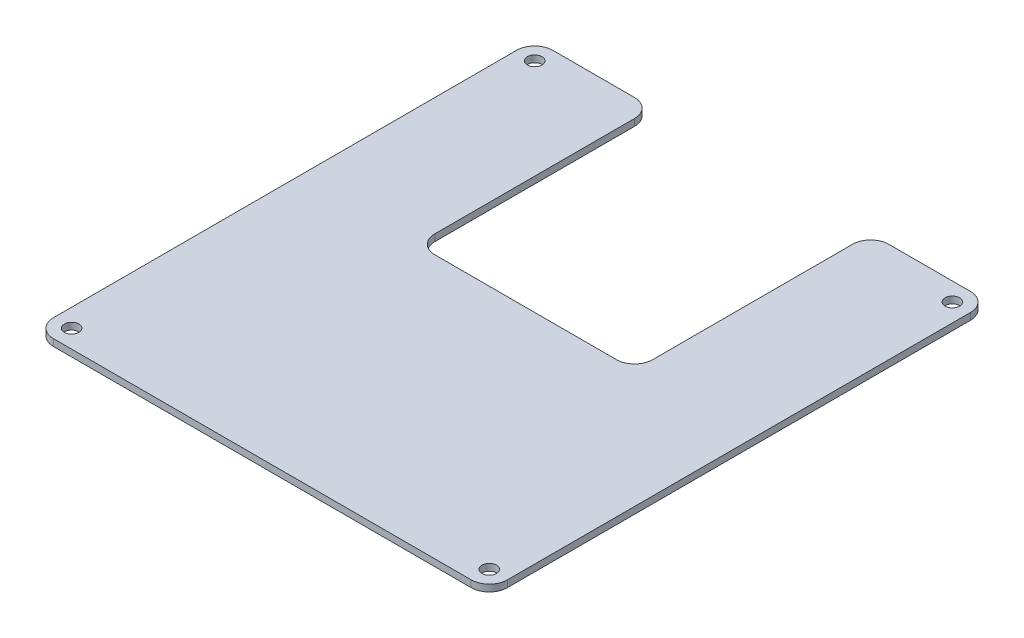
ISO-10303-21;
HEADER;
FILE_DESCRIPTION(('STEP AP214'),'2;1');
FILE_NAME('part.step','',(''),(''),'','','');
FILE_SCHEMA(('AUTOMOTIVE_DESIGN { 1 0 10303 214 1 1 1 1 }'));
ENDSEC;
DATA;
#1=APPLICATION_CONTEXT('core data for automotive mechanical design processes');
#2=APPLICATION_PROTOCOL_DEFINITION('international standard','automotive_design',2000,#1);
#3=PRODUCT_CONTEXT('',#1,'mechanical');
#4=PRODUCT('Part','Part','',(#3));
#5=PRODUCT_RELATED_PRODUCT_CATEGORY('part','',(#4));
#6=PRODUCT_DEFINITION_FORMATION('','',#4);
#7=PRODUCT_DEFINITION_CONTEXT('part definition',#1,'design');
#8=PRODUCT_DEFINITION('design','',#6,#7);
#9=PRODUCT_DEFINITION_SHAPE('','',#8);
#10=(LENGTH_UNIT() NAMED_UNIT(*) SI_UNIT(.MILLI.,.METRE.));
#11=(NAMED_UNIT(*) PLANE_ANGLE_UNIT() SI_UNIT($,.RADIAN.));
#12=(NAMED_UNIT(*) SI_UNIT($,.STERADIAN.) SOLID_ANGLE_UNIT());
#13=UNCERTAINTY_MEASURE_WITH_UNIT(LENGTH_MEASURE(1.E-05),#10,'distance_accuracy_value','');
#14=(GEOMETRIC_REPRESENTATION_CONTEXT(3) GLOBAL_UNCERTAINTY_ASSIGNED_CONTEXT((#13)) GLOBAL_UNIT_ASSIGNED_CONTEXT((#10,
#11,#12)) REPRESENTATION_CONTEXT('',''));
#15=CARTESIAN_POINT('',(0.,0.,0.));
#16=DIRECTION('',(0.,0.,1.));
#17=DIRECTION('',(1.,0.,0.));
#18=AXIS2_PLACEMENT_3D('',#15,#16,#17);
#19=CARTESIAN_POINT('',(-50.,1.5,-55.));
#20=DIRECTION('',(0.,0.,1.));
#21=DIRECTION('',(1.,0.,0.));
#22=AXIS2_PLACEMENT_3D('',#19,#20,#21);
#23=PLANE('',#22);
#24=DIRECTION('',(-1.,0.,0.));
#25=VECTOR('',#24,1.);
#26=CARTESIAN_POINT('',(-50.,1.5,-55.));
#27=LINE('',#26,#25);
#28=CARTESIAN_POINT('',(-28.,1.5,-55.));
#29=VERTEX_POINT('',#28);
#30=CARTESIAN_POINT('',(-46.,1.5,-55.));
#31=VERTEX_POINT('',#30);
#32=EDGE_CURVE('E197',#29,#31,#27,.T.);
#33=ORIENTED_EDGE('',*,*,#32,.F.);
#34=DIRECTION('',(0.,-1.,0.));
#35=VECTOR('',#34,1.);
#36=CARTESIAN_POINT('',(-28.,1.5,-55.));
#37=LINE('',#36,#35);
#38=CARTESIAN_POINT('',(-28.,0.,-55.));
#39=VERTEX_POINT('',#38);
#40=EDGE_CURVE('E228',#29,#39,#37,.T.);
#41=ORIENTED_EDGE('',*,*,#40,.T.);
#42=DIRECTION('',(-1.,0.,0.));
#43=VECTOR('',#42,1.);
#44=CARTESIAN_POINT('',(-50.,0.,-55.));
#45=LINE('',#44,#43);
#46=CARTESIAN_POINT('',(-46.,0.,-55.));
#47=VERTEX_POINT('',#46);
#48=EDGE_CURVE('E209',#39,#47,#45,.T.);
#49=ORIENTED_EDGE('',*,*,#48,.T.);
#50=DIRECTION('',(0.,-1.,0.));
#51=VECTOR('',#50,1.);
#52=CARTESIAN_POINT('',(-46.,1.5,-55.));
#53=LINE('',#52,#51);
#54=EDGE_CURVE('E226',#47,#31,#53,.F.);
#55=ORIENTED_EDGE('',*,*,#54,.T.);
#56=EDGE_LOOP('',(#33,#41,#49,#55));
#57=FACE_BOUND('',#56,.T.);
#58=ADVANCED_FACE('F37',(#57),#23,.F.);
#59=CARTESIAN_POINT('',(50.,1.5,55.));
#60=DIRECTION('',(-1.,0.,0.));
#61=DIRECTION('',(0.,0.,1.));
#62=AXIS2_PLACEMENT_3D('',#59,#60,#61);
#63=PLANE('',#62);
#64=DIRECTION('',(0.,0.,-1.));
#65=VECTOR('',#64,1.);
#66=CARTESIAN_POINT('',(50.,0.,55.));
#67=LINE('',#66,#65);
#68=CARTESIAN_POINT('',(50.,0.,51.));
#69=VERTEX_POINT('',#68);
#70=CARTESIAN_POINT('',(50.,0.,-51.));
#71=VERTEX_POINT('',#70);
#72=EDGE_CURVE('E194',#69,#71,#67,.T.);
#73=ORIENTED_EDGE('',*,*,#72,.T.);
#74=DIRECTION('',(0.,-1.,0.));
#75=VECTOR('',#74,1.);
#76=CARTESIAN_POINT('',(50.,1.5,-51.));
#77=LINE('',#76,#75);
#78=CARTESIAN_POINT('',(50.,1.5,-51.));
#79=VERTEX_POINT('',#78);
#80=EDGE_CURVE('E261',#71,#79,#77,.F.);
#81=ORIENTED_EDGE('',*,*,#80,.T.);
#82=DIRECTION('',(0.,0.,-1.));
#83=VECTOR('',#82,1.);
#84=CARTESIAN_POINT('',(50.,1.5,55.));
#85=LINE('',#84,#83);
#86=CARTESIAN_POINT('',(50.,1.5,51.));
#87=VERTEX_POINT('',#86);
#88=EDGE_CURVE('E195',#87,#79,#85,.T.);
#89=ORIENTED_EDGE('',*,*,#88,.F.);
#90=DIRECTION('',(0.,-1.,0.));
#91=VECTOR('',#90,1.);
#92=CARTESIAN_POINT('',(50.,1.5,51.));
#93=LINE('',#92,#91);
#94=EDGE_CURVE('E258',#87,#69,#93,.T.);
#95=ORIENTED_EDGE('',*,*,#94,.T.);
#96=EDGE_LOOP('',(#73,#81,#89,#95));
#97=FACE_BOUND('',#96,.T.);
#98=ADVANCED_FACE('F289',(#97),#63,.F.);
#99=CARTESIAN_POINT('',(46.,0.,-55.));
#100=VERTEX_POINT('',#99);
#101=CARTESIAN_POINT('',(28.,0.,-55.));
#102=VERTEX_POINT('',#101);
#103=EDGE_CURVE('E210',#100,#102,#45,.T.);
#104=ORIENTED_EDGE('',*,*,#103,.T.);
#105=DIRECTION('',(0.,-1.,0.));
#106=VECTOR('',#105,1.);
#107=CARTESIAN_POINT('',(28.,1.5,-55.));
#108=LINE('',#107,#106);
#109=CARTESIAN_POINT('',(28.,1.5,-55.));
#110=VERTEX_POINT('',#109);
#111=EDGE_CURVE('E52',#102,#110,#108,.F.);
#112=ORIENTED_EDGE('',*,*,#111,.T.);
#113=CARTESIAN_POINT('',(46.,1.5,-55.));
#114=VERTEX_POINT('',#113);
#115=EDGE_CURVE('E199',#114,#110,#27,.T.);
#116=ORIENTED_EDGE('',*,*,#115,.F.);
#117=DIRECTION('',(0.,-1.,0.));
#118=VECTOR('',#117,1.);
#119=CARTESIAN_POINT('',(46.,1.5,-55.));
#120=LINE('',#119,#118);
#121=EDGE_CURVE('E254',#114,#100,#120,.T.);
#122=ORIENTED_EDGE('',*,*,#121,.T.);
#123=EDGE_LOOP('',(#104,#112,#116,#122));
#124=FACE_BOUND('',#123,.T.);
#125=ADVANCED_FACE('F282',(#124),#23,.F.);
#126=CARTESIAN_POINT('',(-50.,1.5,55.));
#127=DIRECTION('',(1.,0.,0.));
#128=DIRECTION('',(0.,0.,-1.));
#129=AXIS2_PLACEMENT_3D('',#126,#127,#128);
#130=PLANE('',#129);
#131=DIRECTION('',(0.,0.,1.));
#132=VECTOR('',#131,1.);
#133=CARTESIAN_POINT('',(-50.,1.5,55.));
#134=LINE('',#133,#132);
#135=CARTESIAN_POINT('',(-50.,1.5,-51.));
#136=VERTEX_POINT('',#135);
#137=CARTESIAN_POINT('',(-50.,1.5,51.));
#138=VERTEX_POINT('',#137);
#139=EDGE_CURVE('E201',#136,#138,#134,.T.);
#140=ORIENTED_EDGE('',*,*,#139,.F.);
#141=DIRECTION('',(0.,-1.,0.));
#142=VECTOR('',#141,1.);
#143=CARTESIAN_POINT('',(-50.,1.5,-51.));
#144=LINE('',#143,#142);
#145=CARTESIAN_POINT('',(-50.,0.,-51.));
#146=VERTEX_POINT('',#145);
#147=EDGE_CURVE('E265',#136,#146,#144,.T.);
#148=ORIENTED_EDGE('',*,*,#147,.T.);
#149=DIRECTION('',(0.,0.,1.));
#150=VECTOR('',#149,1.);
#151=CARTESIAN_POINT('',(-50.,0.,55.));
#152=LINE('',#151,#150);
#153=CARTESIAN_POINT('',(-50.,0.,51.));
#154=VERTEX_POINT('',#153);
#155=EDGE_CURVE('E212',#146,#154,#152,.T.);
#156=ORIENTED_EDGE('',*,*,#155,.T.);
#157=DIRECTION('',(0.,-1.,0.));
#158=VECTOR('',#157,1.);
#159=CARTESIAN_POINT('',(-50.,1.5,51.));
#160=LINE('',#159,#158);
#161=EDGE_CURVE('E263',#154,#138,#160,.F.);
#162=ORIENTED_EDGE('',*,*,#161,.T.);
#163=EDGE_LOOP('',(#140,#148,#156,#162));
#164=FACE_BOUND('',#163,.T.);
#165=ADVANCED_FACE('F307',(#164),#130,.F.);
#166=CARTESIAN_POINT('',(-50.,1.5,55.));
#167=DIRECTION('',(0.,0.,-1.));
#168=DIRECTION('',(-1.,0.,0.));
#169=AXIS2_PLACEMENT_3D('',#166,#167,#168);
#170=PLANE('',#169);
#171=DIRECTION('',(1.,0.,0.));
#172=VECTOR('',#171,1.);
#173=CARTESIAN_POINT('',(-50.,0.,55.));
#174=LINE('',#173,#172);
#175=CARTESIAN_POINT('',(-46.,0.,55.));
#176=VERTEX_POINT('',#175);
#177=CARTESIAN_POINT('',(46.,0.,55.));
#178=VERTEX_POINT('',#177);
#179=EDGE_CURVE('E198',#176,#178,#174,.T.);
#180=ORIENTED_EDGE('',*,*,#179,.T.);
#181=DIRECTION('',(0.,-1.,0.));
#182=VECTOR('',#181,1.);
#183=CARTESIAN_POINT('',(46.,1.5,55.));
#184=LINE('',#183,#182);
#185=CARTESIAN_POINT('',(46.,1.5,55.));
#186=VERTEX_POINT('',#185);
#187=EDGE_CURVE('E162',#178,#186,#184,.F.);
#188=ORIENTED_EDGE('',*,*,#187,.T.);
#189=DIRECTION('',(1.,0.,0.));
#190=VECTOR('',#189,1.);
#191=CARTESIAN_POINT('',(-50.,1.5,55.));
#192=LINE('',#191,#190);
#193=CARTESIAN_POINT('',(-46.,1.5,55.));
#194=VERTEX_POINT('',#193);
#195=EDGE_CURVE('E204',#194,#186,#192,.T.);
#196=ORIENTED_EDGE('',*,*,#195,.F.);
#197=DIRECTION('',(0.,-1.,0.));
#198=VECTOR('',#197,1.);
#199=CARTESIAN_POINT('',(-46.,1.5,55.));
#200=LINE('',#199,#198);
#201=EDGE_CURVE('E268',#194,#176,#200,.T.);
#202=ORIENTED_EDGE('',*,*,#201,.T.);
#203=EDGE_LOOP('',(#180,#188,#196,#202));
#204=FACE_BOUND('',#203,.T.);
#205=ADVANCED_FACE('F298',(#204),#170,.F.);
#206=CARTESIAN_POINT('',(0.,1.5,0.));
#207=DIRECTION('',(0.,-1.,0.));
#208=DIRECTION('',(0.,0.,-1.));
#209=AXIS2_PLACEMENT_3D('',#206,#207,#208);
#210=PLANE('',#209);
#211=CARTESIAN_POINT('',(46.,1.5,51.));
#212=DIRECTION('',(0.,-1.,0.));
#213=DIRECTION('',(0.,0.,-1.));
#214=AXIS2_PLACEMENT_3D('',#211,#212,#213);
#215=CIRCLE('',#214,1.6);
#216=CARTESIAN_POINT('',(46.,1.5,49.4));
#217=VERTEX_POINT('',#216);
#218=EDGE_CURVE('E184',#217,#217,#215,.T.);
#219=ORIENTED_EDGE('',*,*,#218,.T.);
#220=EDGE_LOOP('',(#219));
#221=FACE_BOUND('',#220,.T.);
#222=CARTESIAN_POINT('',(46.,1.5,-51.));
#223=DIRECTION('',(0.,-1.,0.));
#224=DIRECTION('',(0.,0.,-1.));
#225=AXIS2_PLACEMENT_3D('',#222,#223,#224);
#226=CIRCLE('',#225,1.6);
#227=CARTESIAN_POINT('',(46.,1.5,-52.6));
#228=VERTEX_POINT('',#227);
#229=EDGE_CURVE('E389',#228,#228,#226,.T.);
#230=ORIENTED_EDGE('',*,*,#229,.T.);
#231=EDGE_LOOP('',(#230));
#232=FACE_BOUND('',#231,.T.);
#233=CARTESIAN_POINT('',(-46.,1.5,-51.));
#234=DIRECTION('',(0.,-1.,0.));
#235=DIRECTION('',(0.,0.,-1.));
#236=AXIS2_PLACEMENT_3D('',#233,#234,#235);
#237=CIRCLE('',#236,1.6);
#238=CARTESIAN_POINT('',(-46.,1.5,-52.6));
#239=VERTEX_POINT('',#238);
#240=EDGE_CURVE('E387',#239,#239,#237,.T.);
#241=ORIENTED_EDGE('',*,*,#240,.T.);
#242=EDGE_LOOP('',(#241));
#243=FACE_BOUND('',#242,.T.);
#244=CARTESIAN_POINT('',(-46.,1.5,51.));
#245=DIRECTION('',(0.,-1.,0.));
#246=DIRECTION('',(0.,0.,-1.));
#247=AXIS2_PLACEMENT_3D('',#244,#245,#246);
#248=CIRCLE('',#247,1.6);
#249=CARTESIAN_POINT('',(-46.,1.5,49.4));
#250=VERTEX_POINT('',#249);
#251=EDGE_CURVE('E390',#250,#250,#248,.T.);
#252=ORIENTED_EDGE('',*,*,#251,.T.);
#253=EDGE_LOOP('',(#252));
#254=FACE_BOUND('',#253,.T.);
#255=DIRECTION('',(0.,0.,-1.));
#256=VECTOR('',#255,1.);
#257=CARTESIAN_POINT('',(-24.,1.5,0.));
#258=LINE('',#257,#256);
#259=CARTESIAN_POINT('',(-24.,1.5,-7.00000000000001));
#260=VERTEX_POINT('',#259);
#261=CARTESIAN_POINT('',(-24.,1.5,-51.));
#262=VERTEX_POINT('',#261);
#263=EDGE_CURVE('E191',#260,#262,#258,.T.);
#264=ORIENTED_EDGE('',*,*,#263,.T.);
#265=CARTESIAN_POINT('',(-28.,1.5,-51.));
#266=DIRECTION('',(0.,-1.,0.));
#267=DIRECTION('',(0.,0.,-1.));
#268=AXIS2_PLACEMENT_3D('',#265,#266,#267);
#269=CIRCLE('',#268,4.);
#270=EDGE_CURVE('E252',#262,#29,#269,.F.);
#271=ORIENTED_EDGE('',*,*,#270,.T.);
#272=ORIENTED_EDGE('',*,*,#32,.T.);
#273=CARTESIAN_POINT('',(-46.,1.5,-51.));
#274=DIRECTION('',(0.,-1.,0.));
#275=DIRECTION('',(0.,0.,-1.));
#276=AXIS2_PLACEMENT_3D('',#273,#274,#275);
#277=CIRCLE('',#276,4.);
#278=EDGE_CURVE('E247',#31,#136,#277,.F.);
#279=ORIENTED_EDGE('',*,*,#278,.T.);
#280=ORIENTED_EDGE('',*,*,#139,.T.);
#281=CARTESIAN_POINT('',(-46.,1.5,51.));
#282=DIRECTION('',(0.,-1.,0.));
#283=DIRECTION('',(0.,0.,-1.));
#284=AXIS2_PLACEMENT_3D('',#281,#282,#283);
#285=CIRCLE('',#284,4.);
#286=EDGE_CURVE('E243',#138,#194,#285,.F.);
#287=ORIENTED_EDGE('',*,*,#286,.T.);
#288=ORIENTED_EDGE('',*,*,#195,.T.);
#289=CARTESIAN_POINT('',(46.,1.5,51.));
#290=DIRECTION('',(0.,-1.,0.));
#291=DIRECTION('',(0.,0.,-1.));
#292=AXIS2_PLACEMENT_3D('',#289,#290,#291);
#293=CIRCLE('',#292,4.);
#294=EDGE_CURVE('E245',#186,#87,#293,.F.);
#295=ORIENTED_EDGE('',*,*,#294,.T.);
#296=ORIENTED_EDGE('',*,*,#88,.T.);
#297=CARTESIAN_POINT('',(46.,1.5,-51.));
#298=DIRECTION('',(0.,-1.,0.));
#299=DIRECTION('',(0.,0.,-1.));
#300=AXIS2_PLACEMENT_3D('',#297,#298,#299);
#301=CIRCLE('',#300,4.);
#302=EDGE_CURVE('E59',#79,#114,#301,.F.);
#303=ORIENTED_EDGE('',*,*,#302,.T.);
#304=ORIENTED_EDGE('',*,*,#115,.T.);
#305=CARTESIAN_POINT('',(28.,1.5,-51.));
#306=DIRECTION('',(0.,-1.,0.));
#307=DIRECTION('',(0.,0.,-1.));
#308=AXIS2_PLACEMENT_3D('',#305,#306,#307);
#309=CIRCLE('',#308,4.);
#310=CARTESIAN_POINT('',(24.,1.5,-51.));
#311=VERTEX_POINT('',#310);
#312=EDGE_CURVE('E250',#110,#311,#309,.F.);
#313=ORIENTED_EDGE('',*,*,#312,.T.);
#314=DIRECTION('',(0.,0.,1.));
#315=VECTOR('',#314,1.);
#316=CARTESIAN_POINT('',(24.,1.5,0.));
#317=LINE('',#316,#315);
#318=CARTESIAN_POINT('',(24.,1.5,-7.));
#319=VERTEX_POINT('',#318);
#320=EDGE_CURVE('E182',#311,#319,#317,.T.);
#321=ORIENTED_EDGE('',*,*,#320,.T.);
#322=CARTESIAN_POINT('',(20.,1.5,-7.));
#323=DIRECTION('',(0.,-1.,0.));
#324=DIRECTION('',(0.,0.,-1.));
#325=AXIS2_PLACEMENT_3D('',#322,#323,#324);
#326=CIRCLE('',#325,4.);
#327=CARTESIAN_POINT('',(20.,1.5,-3.));
#328=VERTEX_POINT('',#327);
#329=EDGE_CURVE('E161',#319,#328,#326,.T.);
#330=ORIENTED_EDGE('',*,*,#329,.T.);
#331=DIRECTION('',(-1.,0.,0.));
#332=VECTOR('',#331,1.);
#333=CARTESIAN_POINT('',(0.,1.5,-3.00000000000001));
#334=LINE('',#333,#332);
#335=CARTESIAN_POINT('',(-20.,1.5,-3.00000000000001));
#336=VERTEX_POINT('',#335);
#337=EDGE_CURVE('E171',#328,#336,#334,.T.);
#338=ORIENTED_EDGE('',*,*,#337,.T.);
#339=CARTESIAN_POINT('',(-20.,1.5,-7.00000000000001));
#340=DIRECTION('',(0.,-1.,0.));
#341=DIRECTION('',(0.,0.,-1.));
#342=AXIS2_PLACEMENT_3D('',#339,#340,#341);
#343=CIRCLE('',#342,4.);
#344=EDGE_CURVE('E11',#336,#260,#343,.T.);
#345=ORIENTED_EDGE('',*,*,#344,.T.);
#346=EDGE_LOOP('',(#264,#271,#272,#279,#280,#287,#288,#295,#296,#303,#304,#313,#321,#330,#338,#345));
#347=FACE_BOUND('',#346,.T.);
#348=ADVANCED_FACE('F272',(#221,#232,#243,#254,#347),#210,.F.);
#349=CARTESIAN_POINT('',(0.,0.,0.));
#350=DIRECTION('',(0.,-1.,0.));
#351=DIRECTION('',(0.,0.,-1.));
#352=AXIS2_PLACEMENT_3D('',#349,#350,#351);
#353=PLANE('',#352);
#354=CARTESIAN_POINT('',(46.,0.,51.));
#355=DIRECTION('',(0.,-1.,0.));
#356=DIRECTION('',(0.,0.,-1.));
#357=AXIS2_PLACEMENT_3D('',#354,#355,#356);
#358=CIRCLE('',#357,1.6);
#359=CARTESIAN_POINT('',(46.,0.,49.4));
#360=VERTEX_POINT('',#359);
#361=EDGE_CURVE('E409',#360,#360,#358,.T.);
#362=ORIENTED_EDGE('',*,*,#361,.F.);
#363=EDGE_LOOP('',(#362));
#364=FACE_BOUND('',#363,.T.);
#365=CARTESIAN_POINT('',(46.,0.,-51.));
#366=DIRECTION('',(0.,-1.,0.));
#367=DIRECTION('',(0.,0.,-1.));
#368=AXIS2_PLACEMENT_3D('',#365,#366,#367);
#369=CIRCLE('',#368,1.6);
#370=CARTESIAN_POINT('',(46.,0.,-52.6));
#371=VERTEX_POINT('',#370);
#372=EDGE_CURVE('E412',#371,#371,#369,.T.);
#373=ORIENTED_EDGE('',*,*,#372,.F.);
#374=EDGE_LOOP('',(#373));
#375=FACE_BOUND('',#374,.T.);
#376=CARTESIAN_POINT('',(-46.,0.,-51.));
#377=DIRECTION('',(0.,-1.,0.));
#378=DIRECTION('',(0.,0.,-1.));
#379=AXIS2_PLACEMENT_3D('',#376,#377,#378);
#380=CIRCLE('',#379,1.6);
#381=CARTESIAN_POINT('',(-46.,0.,-52.6));
#382=VERTEX_POINT('',#381);
#383=EDGE_CURVE('E384',#382,#382,#380,.T.);
#384=ORIENTED_EDGE('',*,*,#383,.F.);
#385=EDGE_LOOP('',(#384));
#386=FACE_BOUND('',#385,.T.);
#387=CARTESIAN_POINT('',(-46.,0.,51.));
#388=DIRECTION('',(0.,-1.,0.));
#389=DIRECTION('',(0.,0.,-1.));
#390=AXIS2_PLACEMENT_3D('',#387,#388,#389);
#391=CIRCLE('',#390,1.6);
#392=CARTESIAN_POINT('',(-46.,0.,49.4));
#393=VERTEX_POINT('',#392);
#394=EDGE_CURVE('E395',#393,#393,#391,.T.);
#395=ORIENTED_EDGE('',*,*,#394,.F.);
#396=EDGE_LOOP('',(#395));
#397=FACE_BOUND('',#396,.T.);
#398=ORIENTED_EDGE('',*,*,#48,.F.);
#399=CARTESIAN_POINT('',(-28.,0.,-51.));
#400=DIRECTION('',(0.,-1.,0.));
#401=DIRECTION('',(0.,0.,-1.));
#402=AXIS2_PLACEMENT_3D('',#399,#400,#401);
#403=CIRCLE('',#402,4.);
#404=CARTESIAN_POINT('',(-24.,0.,-51.));
#405=VERTEX_POINT('',#404);
#406=EDGE_CURVE('E241',#39,#405,#403,.T.);
#407=ORIENTED_EDGE('',*,*,#406,.T.);
#408=DIRECTION('',(0.,0.,-1.));
#409=VECTOR('',#408,1.);
#410=CARTESIAN_POINT('',(-24.,0.,-55.));
#411=LINE('',#410,#409);
#412=CARTESIAN_POINT('',(-24.,0.,-7.00000000000001));
#413=VERTEX_POINT('',#412);
#414=EDGE_CURVE('E178',#413,#405,#411,.T.);
#415=ORIENTED_EDGE('',*,*,#414,.F.);
#416=CARTESIAN_POINT('',(-20.,0.,-7.00000000000001));
#417=DIRECTION('',(0.,-1.,0.));
#418=DIRECTION('',(0.,0.,-1.));
#419=AXIS2_PLACEMENT_3D('',#416,#417,#418);
#420=CIRCLE('',#419,4.);
#421=CARTESIAN_POINT('',(-20.,0.,-3.00000000000001));
#422=VERTEX_POINT('',#421);
#423=EDGE_CURVE('E45',#413,#422,#420,.F.);
#424=ORIENTED_EDGE('',*,*,#423,.T.);
#425=DIRECTION('',(-1.,0.,0.));
#426=VECTOR('',#425,1.);
#427=CARTESIAN_POINT('',(-24.,0.,-3.00000000000001));
#428=LINE('',#427,#426);
#429=CARTESIAN_POINT('',(20.,0.,-3.));
#430=VERTEX_POINT('',#429);
#431=EDGE_CURVE('E168',#430,#422,#428,.T.);
#432=ORIENTED_EDGE('',*,*,#431,.F.);
#433=CARTESIAN_POINT('',(20.,0.,-7.));
#434=DIRECTION('',(0.,-1.,0.));
#435=DIRECTION('',(0.,0.,-1.));
#436=AXIS2_PLACEMENT_3D('',#433,#434,#435);
#437=CIRCLE('',#436,4.);
#438=CARTESIAN_POINT('',(24.,0.,-7.));
#439=VERTEX_POINT('',#438);
#440=EDGE_CURVE('E151',#430,#439,#437,.F.);
#441=ORIENTED_EDGE('',*,*,#440,.T.);
#442=DIRECTION('',(0.,0.,1.));
#443=VECTOR('',#442,1.);
#444=CARTESIAN_POINT('',(24.,0.,-55.));
#445=LINE('',#444,#443);
#446=CARTESIAN_POINT('',(24.,0.,-51.));
#447=VERTEX_POINT('',#446);
#448=EDGE_CURVE('E179',#447,#439,#445,.T.);
#449=ORIENTED_EDGE('',*,*,#448,.F.);
#450=CARTESIAN_POINT('',(28.,0.,-51.));
#451=DIRECTION('',(0.,-1.,0.));
#452=DIRECTION('',(0.,0.,-1.));
#453=AXIS2_PLACEMENT_3D('',#450,#451,#452);
#454=CIRCLE('',#453,4.);
#455=EDGE_CURVE('E239',#447,#102,#454,.T.);
#456=ORIENTED_EDGE('',*,*,#455,.T.);
#457=ORIENTED_EDGE('',*,*,#103,.F.);
#458=CARTESIAN_POINT('',(46.,0.,-51.));
#459=DIRECTION('',(0.,-1.,0.));
#460=DIRECTION('',(0.,0.,-1.));
#461=AXIS2_PLACEMENT_3D('',#458,#459,#460);
#462=CIRCLE('',#461,4.);
#463=EDGE_CURVE('E237',#100,#71,#462,.T.);
#464=ORIENTED_EDGE('',*,*,#463,.T.);
#465=ORIENTED_EDGE('',*,*,#72,.F.);
#466=CARTESIAN_POINT('',(46.,0.,51.));
#467=DIRECTION('',(0.,-1.,0.));
#468=DIRECTION('',(0.,0.,-1.));
#469=AXIS2_PLACEMENT_3D('',#466,#467,#468);
#470=CIRCLE('',#469,4.);
#471=EDGE_CURVE('E233',#69,#178,#470,.T.);
#472=ORIENTED_EDGE('',*,*,#471,.T.);
#473=ORIENTED_EDGE('',*,*,#179,.F.);
#474=CARTESIAN_POINT('',(-46.,0.,51.));
#475=DIRECTION('',(0.,-1.,0.));
#476=DIRECTION('',(0.,0.,-1.));
#477=AXIS2_PLACEMENT_3D('',#474,#475,#476);
#478=CIRCLE('',#477,4.);
#479=EDGE_CURVE('E231',#176,#154,#478,.T.);
#480=ORIENTED_EDGE('',*,*,#479,.T.);
#481=ORIENTED_EDGE('',*,*,#155,.F.);
#482=CARTESIAN_POINT('',(-46.,0.,-51.));
#483=DIRECTION('',(0.,-1.,0.));
#484=DIRECTION('',(0.,0.,-1.));
#485=AXIS2_PLACEMENT_3D('',#482,#483,#484);
#486=CIRCLE('',#485,4.);
#487=EDGE_CURVE('E235',#146,#47,#486,.T.);
#488=ORIENTED_EDGE('',*,*,#487,.T.);
#489=EDGE_LOOP('',(#398,#407,#415,#424,#432,#441,#449,#456,#457,#464,#465,#472,#473,#480,#481,#488));
#490=FACE_BOUND('',#489,.T.);
#491=ADVANCED_FACE('F176',(#364,#375,#386,#397,#490),#353,.T.);
#492=CARTESIAN_POINT('',(-24.,10.,-55.));
#493=DIRECTION('',(-1.,0.,0.));
#494=DIRECTION('',(0.,0.,1.));
#495=AXIS2_PLACEMENT_3D('',#492,#493,#494);
#496=PLANE('',#495);
#497=ORIENTED_EDGE('',*,*,#263,.F.);
#498=DIRECTION('',(0.,-1.,0.));
#499=VECTOR('',#498,1.);
#500=CARTESIAN_POINT('',(-24.,0.,-7.00000000000001));
#501=LINE('',#500,#499);
#502=EDGE_CURVE('E223',#260,#413,#501,.T.);
#503=ORIENTED_EDGE('',*,*,#502,.T.);
#504=ORIENTED_EDGE('',*,*,#414,.T.);
#505=DIRECTION('',(0.,-1.,0.));
#506=VECTOR('',#505,1.);
#507=CARTESIAN_POINT('',(-24.,10.,-51.));
#508=LINE('',#507,#506);
#509=EDGE_CURVE('E221',#405,#262,#508,.F.);
#510=ORIENTED_EDGE('',*,*,#509,.T.);
#511=EDGE_LOOP('',(#497,#503,#504,#510));
#512=FACE_BOUND('',#511,.T.);
#513=ADVANCED_FACE('F324',(#512),#496,.F.);
#514=CARTESIAN_POINT('',(-24.,10.,-3.00000000000001));
#515=DIRECTION('',(0.,0.,1.));
#516=DIRECTION('',(1.,0.,0.));
#517=AXIS2_PLACEMENT_3D('',#514,#515,#516);
#518=PLANE('',#517);
#519=ORIENTED_EDGE('',*,*,#337,.F.);
#520=DIRECTION('',(0.,-1.,0.));
#521=VECTOR('',#520,1.);
#522=CARTESIAN_POINT('',(20.,0.,-3.));
#523=LINE('',#522,#521);
#524=EDGE_CURVE('E155',#328,#430,#523,.T.);
#525=ORIENTED_EDGE('',*,*,#524,.T.);
#526=ORIENTED_EDGE('',*,*,#431,.T.);
#527=DIRECTION('',(0.,-1.,0.));
#528=VECTOR('',#527,1.);
#529=CARTESIAN_POINT('',(-20.,1.5,-3.00000000000001));
#530=LINE('',#529,#528);
#531=EDGE_CURVE('E173',#422,#336,#530,.F.);
#532=ORIENTED_EDGE('',*,*,#531,.T.);
#533=EDGE_LOOP('',(#519,#525,#526,#532));
#534=FACE_BOUND('',#533,.T.);
#535=ADVANCED_FACE('F167',(#534),#518,.F.);
#536=CARTESIAN_POINT('',(24.,10.,-55.));
#537=DIRECTION('',(1.,0.,0.));
#538=DIRECTION('',(0.,0.,-1.));
#539=AXIS2_PLACEMENT_3D('',#536,#537,#538);
#540=PLANE('',#539);
#541=ORIENTED_EDGE('',*,*,#448,.T.);
#542=DIRECTION('',(0.,-1.,0.));
#543=VECTOR('',#542,1.);
#544=CARTESIAN_POINT('',(24.,1.5,-7.));
#545=LINE('',#544,#543);
#546=EDGE_CURVE('E156',#439,#319,#545,.F.);
#547=ORIENTED_EDGE('',*,*,#546,.T.);
#548=ORIENTED_EDGE('',*,*,#320,.F.);
#549=DIRECTION('',(0.,-1.,0.));
#550=VECTOR('',#549,1.);
#551=CARTESIAN_POINT('',(24.,10.,-51.));
#552=LINE('',#551,#550);
#553=EDGE_CURVE('E172',#311,#447,#552,.T.);
#554=ORIENTED_EDGE('',*,*,#553,.T.);
#555=EDGE_LOOP('',(#541,#547,#548,#554));
#556=FACE_BOUND('',#555,.T.);
#557=ADVANCED_FACE('F278',(#556),#540,.F.);
#558=CARTESIAN_POINT('',(20.,10.,-7.));
#559=DIRECTION('',(0.,1.,0.));
#560=DIRECTION('',(0.,0.,1.));
#561=AXIS2_PLACEMENT_3D('',#558,#559,#560);
#562=CYLINDRICAL_SURFACE('',#561,4.);
#563=ORIENTED_EDGE('',*,*,#329,.F.);
#564=ORIENTED_EDGE('',*,*,#546,.F.);
#565=ORIENTED_EDGE('',*,*,#440,.F.);
#566=ORIENTED_EDGE('',*,*,#524,.F.);
#567=EDGE_LOOP('',(#563,#564,#565,#566));
#568=FACE_BOUND('',#567,.T.);
#569=ADVANCED_FACE('F154',(#568),#562,.F.);
#570=CARTESIAN_POINT('',(-20.,10.,-7.00000000000001));
#571=DIRECTION('',(0.,1.,0.));
#572=DIRECTION('',(0.,0.,1.));
#573=AXIS2_PLACEMENT_3D('',#570,#571,#572);
#574=CYLINDRICAL_SURFACE('',#573,4.);
#575=ORIENTED_EDGE('',*,*,#344,.F.);
#576=ORIENTED_EDGE('',*,*,#531,.F.);
#577=ORIENTED_EDGE('',*,*,#423,.F.);
#578=ORIENTED_EDGE('',*,*,#502,.F.);
#579=EDGE_LOOP('',(#575,#576,#577,#578));
#580=FACE_BOUND('',#579,.T.);
#581=ADVANCED_FACE('F327',(#580),#574,.F.);
#582=CARTESIAN_POINT('',(-28.,1.5,-51.));
#583=DIRECTION('',(0.,-1.,0.));
#584=DIRECTION('',(0.,0.,-1.));
#585=AXIS2_PLACEMENT_3D('',#582,#583,#584);
#586=CYLINDRICAL_SURFACE('',#585,4.);
#587=ORIENTED_EDGE('',*,*,#270,.F.);
#588=ORIENTED_EDGE('',*,*,#509,.F.);
#589=ORIENTED_EDGE('',*,*,#406,.F.);
#590=ORIENTED_EDGE('',*,*,#40,.F.);
#591=EDGE_LOOP('',(#587,#588,#589,#590));
#592=FACE_BOUND('',#591,.T.);
#593=ADVANCED_FACE('F320',(#592),#586,.T.);
#594=CARTESIAN_POINT('',(28.,10.,-51.));
#595=DIRECTION('',(0.,-1.,0.));
#596=DIRECTION('',(0.,0.,-1.));
#597=AXIS2_PLACEMENT_3D('',#594,#595,#596);
#598=CYLINDRICAL_SURFACE('',#597,4.);
#599=ORIENTED_EDGE('',*,*,#312,.F.);
#600=ORIENTED_EDGE('',*,*,#111,.F.);
#601=ORIENTED_EDGE('',*,*,#455,.F.);
#602=ORIENTED_EDGE('',*,*,#553,.F.);
#603=EDGE_LOOP('',(#599,#600,#601,#602));
#604=FACE_BOUND('',#603,.T.);
#605=ADVANCED_FACE('F280',(#604),#598,.T.);
#606=CARTESIAN_POINT('',(46.,1.5,-51.));
#607=DIRECTION('',(0.,-1.,0.));
#608=DIRECTION('',(0.,0.,-1.));
#609=AXIS2_PLACEMENT_3D('',#606,#607,#608);
#610=CYLINDRICAL_SURFACE('',#609,4.);
#611=ORIENTED_EDGE('',*,*,#302,.F.);
#612=ORIENTED_EDGE('',*,*,#80,.F.);
#613=ORIENTED_EDGE('',*,*,#463,.F.);
#614=ORIENTED_EDGE('',*,*,#121,.F.);
#615=EDGE_LOOP('',(#611,#612,#613,#614));
#616=FACE_BOUND('',#615,.T.);
#617=ADVANCED_FACE('F285',(#616),#610,.T.);
#618=CARTESIAN_POINT('',(-46.,1.5,-51.));
#619=DIRECTION('',(0.,-1.,0.));
#620=DIRECTION('',(0.,0.,-1.));
#621=AXIS2_PLACEMENT_3D('',#618,#619,#620);
#622=CYLINDRICAL_SURFACE('',#621,4.);
#623=ORIENTED_EDGE('',*,*,#278,.F.);
#624=ORIENTED_EDGE('',*,*,#54,.F.);
#625=ORIENTED_EDGE('',*,*,#487,.F.);
#626=ORIENTED_EDGE('',*,*,#147,.F.);
#627=EDGE_LOOP('',(#623,#624,#625,#626));
#628=FACE_BOUND('',#627,.T.);
#629=ADVANCED_FACE('F311',(#628),#622,.T.);
#630=CARTESIAN_POINT('',(46.,1.5,51.));
#631=DIRECTION('',(0.,-1.,0.));
#632=DIRECTION('',(0.,0.,-1.));
#633=AXIS2_PLACEMENT_3D('',#630,#631,#632);
#634=CYLINDRICAL_SURFACE('',#633,4.);
#635=ORIENTED_EDGE('',*,*,#294,.F.);
#636=ORIENTED_EDGE('',*,*,#187,.F.);
#637=ORIENTED_EDGE('',*,*,#471,.F.);
#638=ORIENTED_EDGE('',*,*,#94,.F.);
#639=EDGE_LOOP('',(#635,#636,#637,#638));
#640=FACE_BOUND('',#639,.T.);
#641=ADVANCED_FACE('F294',(#640),#634,.T.);
#642=CARTESIAN_POINT('',(-46.,1.5,51.));
#643=DIRECTION('',(0.,-1.,0.));
#644=DIRECTION('',(0.,0.,-1.));
#645=AXIS2_PLACEMENT_3D('',#642,#643,#644);
#646=CYLINDRICAL_SURFACE('',#645,4.);
#647=ORIENTED_EDGE('',*,*,#286,.F.);
#648=ORIENTED_EDGE('',*,*,#161,.F.);
#649=ORIENTED_EDGE('',*,*,#479,.F.);
#650=ORIENTED_EDGE('',*,*,#201,.F.);
#651=EDGE_LOOP('',(#647,#648,#649,#650));
#652=FACE_BOUND('',#651,.T.);
#653=ADVANCED_FACE('F39',(#652),#646,.T.);
#654=CARTESIAN_POINT('',(-46.,10.,51.));
#655=DIRECTION('',(0.,-1.,0.));
#656=DIRECTION('',(0.,0.,-1.));
#657=AXIS2_PLACEMENT_3D('',#654,#655,#656);
#658=CYLINDRICAL_SURFACE('',#657,1.6);
#659=ORIENTED_EDGE('',*,*,#394,.T.);
#660=EDGE_LOOP('',(#659));
#661=FACE_BOUND('',#660,.T.);
#662=ORIENTED_EDGE('',*,*,#251,.F.);
#663=EDGE_LOOP('',(#662));
#664=FACE_BOUND('',#663,.T.);
#665=ADVANCED_FACE('F364',(#661,#664),#658,.F.);
#666=CARTESIAN_POINT('',(-46.,10.,-51.));
#667=DIRECTION('',(0.,-1.,0.));
#668=DIRECTION('',(0.,0.,-1.));
#669=AXIS2_PLACEMENT_3D('',#666,#667,#668);
#670=CYLINDRICAL_SURFACE('',#669,1.6);
#671=ORIENTED_EDGE('',*,*,#383,.T.);
#672=EDGE_LOOP('',(#671));
#673=FACE_BOUND('',#672,.T.);
#674=ORIENTED_EDGE('',*,*,#240,.F.);
#675=EDGE_LOOP('',(#674));
#676=FACE_BOUND('',#675,.T.);
#677=ADVANCED_FACE('F367',(#673,#676),#670,.F.);
#678=CARTESIAN_POINT('',(46.,10.,-51.));
#679=DIRECTION('',(0.,-1.,0.));
#680=DIRECTION('',(0.,0.,-1.));
#681=AXIS2_PLACEMENT_3D('',#678,#679,#680);
#682=CYLINDRICAL_SURFACE('',#681,1.6);
#683=ORIENTED_EDGE('',*,*,#372,.T.);
#684=EDGE_LOOP('',(#683));
#685=FACE_BOUND('',#684,.T.);
#686=ORIENTED_EDGE('',*,*,#229,.F.);
#687=EDGE_LOOP('',(#686));
#688=FACE_BOUND('',#687,.T.);
#689=ADVANCED_FACE('F372',(#685,#688),#682,.F.);
#690=CARTESIAN_POINT('',(46.,10.,51.));
#691=DIRECTION('',(0.,-1.,0.));
#692=DIRECTION('',(0.,0.,-1.));
#693=AXIS2_PLACEMENT_3D('',#690,#691,#692);
#694=CYLINDRICAL_SURFACE('',#693,1.6);
#695=ORIENTED_EDGE('',*,*,#361,.T.);
#696=EDGE_LOOP('',(#695));
#697=FACE_BOUND('',#696,.T.);
#698=ORIENTED_EDGE('',*,*,#218,.F.);
#699=EDGE_LOOP('',(#698));
#700=FACE_BOUND('',#699,.T.);
#701=ADVANCED_FACE('F369',(#697,#700),#694,.F.);
#702=CLOSED_SHELL('',(#58,#98,#125,#165,#205,#348,#491,#513,#535,#557,#569,#581,#593,#605,#617,
#629,#641,#653,#665,#677,#689,#701));
#703=MANIFOLD_SOLID_BREP('B2',#702);
#704=ADVANCED_BREP_SHAPE_REPRESENTATION('',(#18,#703),#14);
#705=SHAPE_DEFINITION_REPRESENTATION(#9,#704);
ENDSEC;
END-ISO-10303-21;
